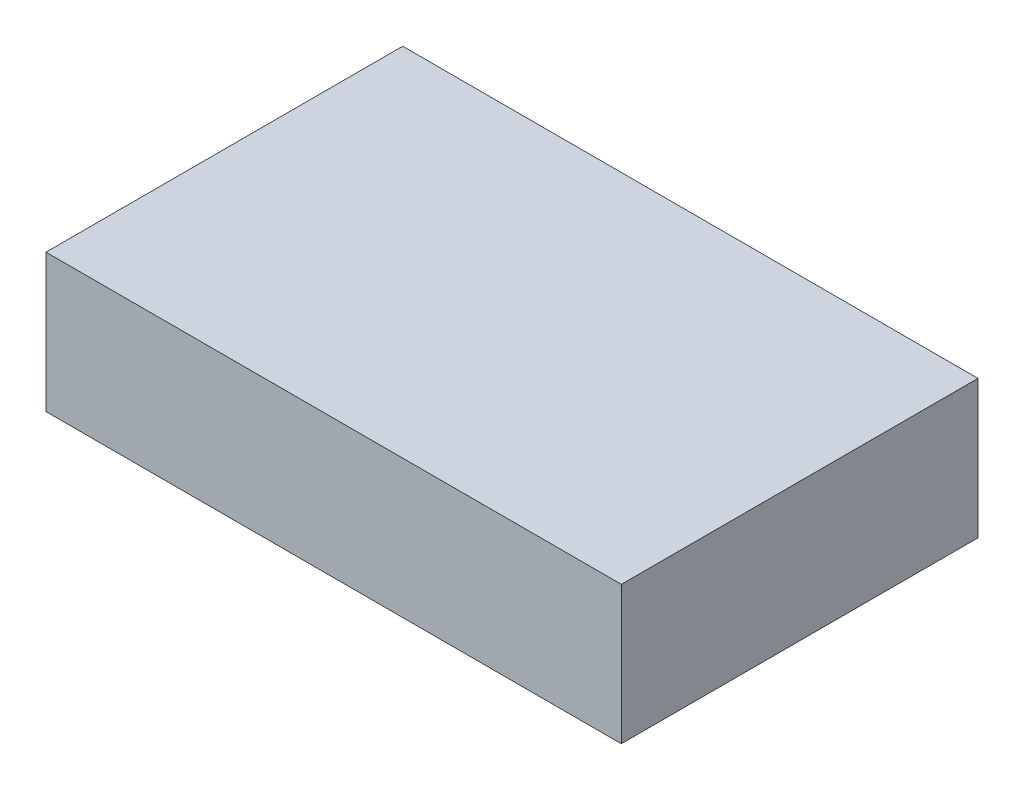
ISO-10303-21;
HEADER;
FILE_DESCRIPTION(('STEP AP214'),'2;1');
FILE_NAME('part.step','',(''),(''),'','','');
FILE_SCHEMA(('AUTOMOTIVE_DESIGN { 1 0 10303 214 1 1 1 1 }'));
ENDSEC;
DATA;
#1=APPLICATION_CONTEXT('core data for automotive mechanical design processes');
#2=APPLICATION_PROTOCOL_DEFINITION('international standard','automotive_design',2000,#1);
#3=PRODUCT_CONTEXT('',#1,'mechanical');
#4=PRODUCT('Part','Part','',(#3));
#5=PRODUCT_RELATED_PRODUCT_CATEGORY('part','',(#4));
#6=PRODUCT_DEFINITION_FORMATION('','',#4);
#7=PRODUCT_DEFINITION_CONTEXT('part definition',#1,'design');
#8=PRODUCT_DEFINITION('design','',#6,#7);
#9=PRODUCT_DEFINITION_SHAPE('','',#8);
#10=(LENGTH_UNIT() NAMED_UNIT(*) SI_UNIT(.MILLI.,.METRE.));
#11=(NAMED_UNIT(*) PLANE_ANGLE_UNIT() SI_UNIT($,.RADIAN.));
#12=(NAMED_UNIT(*) SI_UNIT($,.STERADIAN.) SOLID_ANGLE_UNIT());
#13=UNCERTAINTY_MEASURE_WITH_UNIT(LENGTH_MEASURE(1.E-05),#10,'distance_accuracy_value','');
#14=(GEOMETRIC_REPRESENTATION_CONTEXT(3) GLOBAL_UNCERTAINTY_ASSIGNED_CONTEXT((#13)) GLOBAL_UNIT_ASSIGNED_CONTEXT((#10,
#11,#12)) REPRESENTATION_CONTEXT('',''));
#15=CARTESIAN_POINT('',(0.,0.,0.));
#16=DIRECTION('',(0.,0.,1.));
#17=DIRECTION('',(1.,0.,0.));
#18=AXIS2_PLACEMENT_3D('',#15,#16,#17);
#19=CARTESIAN_POINT('',(79.375,38.1,49.2125));
#20=DIRECTION('',(-1.,0.,0.));
#21=DIRECTION('',(0.,0.,1.));
#22=AXIS2_PLACEMENT_3D('',#19,#20,#21);
#23=PLANE('',#22);
#24=DIRECTION('',(0.,0.,-1.));
#25=VECTOR('',#24,1.);
#26=CARTESIAN_POINT('',(79.375,0.,49.2125));
#27=LINE('',#26,#25);
#28=CARTESIAN_POINT('',(79.375,0.,49.2125));
#29=VERTEX_POINT('',#28);
#30=CARTESIAN_POINT('',(79.375,0.,-49.2125));
#31=VERTEX_POINT('',#30);
#32=EDGE_CURVE('E107',#29,#31,#27,.T.);
#33=ORIENTED_EDGE('',*,*,#32,.T.);
#34=DIRECTION('',(0.,-1.,0.));
#35=VECTOR('',#34,1.);
#36=CARTESIAN_POINT('',(79.375,38.1,-49.2125));
#37=LINE('',#36,#35);
#38=CARTESIAN_POINT('',(79.375,38.1,-49.2125));
#39=VERTEX_POINT('',#38);
#40=EDGE_CURVE('E11',#39,#31,#37,.T.);
#41=ORIENTED_EDGE('',*,*,#40,.F.);
#42=DIRECTION('',(0.,0.,-1.));
#43=VECTOR('',#42,1.);
#44=CARTESIAN_POINT('',(79.375,38.1,49.2125));
#45=LINE('',#44,#43);
#46=CARTESIAN_POINT('',(79.375,38.1,49.2125));
#47=VERTEX_POINT('',#46);
#48=EDGE_CURVE('E91',#47,#39,#45,.T.);
#49=ORIENTED_EDGE('',*,*,#48,.F.);
#50=DIRECTION('',(0.,-1.,0.));
#51=VECTOR('',#50,1.);
#52=CARTESIAN_POINT('',(79.375,38.1,49.2125));
#53=LINE('',#52,#51);
#54=EDGE_CURVE('E103',#47,#29,#53,.T.);
#55=ORIENTED_EDGE('',*,*,#54,.T.);
#56=EDGE_LOOP('',(#33,#41,#49,#55));
#57=FACE_BOUND('',#56,.T.);
#58=ADVANCED_FACE('F39',(#57),#23,.F.);
#59=CARTESIAN_POINT('',(-79.375,38.1,-49.2125));
#60=DIRECTION('',(0.,0.,1.));
#61=DIRECTION('',(1.,0.,0.));
#62=AXIS2_PLACEMENT_3D('',#59,#60,#61);
#63=PLANE('',#62);
#64=DIRECTION('',(-1.,0.,0.));
#65=VECTOR('',#64,1.);
#66=CARTESIAN_POINT('',(-79.375,0.,-49.2125));
#67=LINE('',#66,#65);
#68=CARTESIAN_POINT('',(-79.375,0.,-49.2125));
#69=VERTEX_POINT('',#68);
#70=EDGE_CURVE('E96',#31,#69,#67,.T.);
#71=ORIENTED_EDGE('',*,*,#70,.T.);
#72=DIRECTION('',(0.,-1.,0.));
#73=VECTOR('',#72,1.);
#74=CARTESIAN_POINT('',(-79.375,38.1,-49.2125));
#75=LINE('',#74,#73);
#76=CARTESIAN_POINT('',(-79.375,38.1,-49.2125));
#77=VERTEX_POINT('',#76);
#78=EDGE_CURVE('E48',#77,#69,#75,.T.);
#79=ORIENTED_EDGE('',*,*,#78,.F.);
#80=DIRECTION('',(-1.,0.,0.));
#81=VECTOR('',#80,1.);
#82=CARTESIAN_POINT('',(-79.375,38.1,-49.2125));
#83=LINE('',#82,#81);
#84=EDGE_CURVE('E86',#39,#77,#83,.T.);
#85=ORIENTED_EDGE('',*,*,#84,.F.);
#86=ORIENTED_EDGE('',*,*,#40,.T.);
#87=EDGE_LOOP('',(#71,#79,#85,#86));
#88=FACE_BOUND('',#87,.T.);
#89=ADVANCED_FACE('F95',(#88),#63,.F.);
#90=CARTESIAN_POINT('',(-79.375,38.1,49.2125));
#91=DIRECTION('',(1.,0.,0.));
#92=DIRECTION('',(0.,0.,-1.));
#93=AXIS2_PLACEMENT_3D('',#90,#91,#92);
#94=PLANE('',#93);
#95=DIRECTION('',(0.,0.,1.));
#96=VECTOR('',#95,1.);
#97=CARTESIAN_POINT('',(-79.375,0.,49.2125));
#98=LINE('',#97,#96);
#99=CARTESIAN_POINT('',(-79.375,0.,49.2125));
#100=VERTEX_POINT('',#99);
#101=EDGE_CURVE('E73',#69,#100,#98,.T.);
#102=ORIENTED_EDGE('',*,*,#101,.T.);
#103=DIRECTION('',(0.,-1.,0.));
#104=VECTOR('',#103,1.);
#105=CARTESIAN_POINT('',(-79.375,38.1,49.2125));
#106=LINE('',#105,#104);
#107=CARTESIAN_POINT('',(-79.375,38.1,49.2125));
#108=VERTEX_POINT('',#107);
#109=EDGE_CURVE('E98',#108,#100,#106,.T.);
#110=ORIENTED_EDGE('',*,*,#109,.F.);
#111=DIRECTION('',(0.,0.,1.));
#112=VECTOR('',#111,1.);
#113=CARTESIAN_POINT('',(-79.375,38.1,49.2125));
#114=LINE('',#113,#112);
#115=EDGE_CURVE('E89',#77,#108,#114,.T.);
#116=ORIENTED_EDGE('',*,*,#115,.F.);
#117=ORIENTED_EDGE('',*,*,#78,.T.);
#118=EDGE_LOOP('',(#102,#110,#116,#117));
#119=FACE_BOUND('',#118,.T.);
#120=ADVANCED_FACE('F99',(#119),#94,.F.);
#121=CARTESIAN_POINT('',(-79.375,38.1,49.2125));
#122=DIRECTION('',(0.,0.,-1.));
#123=DIRECTION('',(-1.,0.,0.));
#124=AXIS2_PLACEMENT_3D('',#121,#122,#123);
#125=PLANE('',#124);
#126=DIRECTION('',(1.,0.,0.));
#127=VECTOR('',#126,1.);
#128=CARTESIAN_POINT('',(-79.375,0.,49.2125));
#129=LINE('',#128,#127);
#130=EDGE_CURVE('E79',#100,#29,#129,.T.);
#131=ORIENTED_EDGE('',*,*,#130,.T.);
#132=ORIENTED_EDGE('',*,*,#54,.F.);
#133=DIRECTION('',(1.,0.,0.));
#134=VECTOR('',#133,1.);
#135=CARTESIAN_POINT('',(-79.375,38.1,49.2125));
#136=LINE('',#135,#134);
#137=EDGE_CURVE('E56',#108,#47,#136,.T.);
#138=ORIENTED_EDGE('',*,*,#137,.F.);
#139=ORIENTED_EDGE('',*,*,#109,.T.);
#140=EDGE_LOOP('',(#131,#132,#138,#139));
#141=FACE_BOUND('',#140,.T.);
#142=ADVANCED_FACE('F120',(#141),#125,.F.);
#143=CARTESIAN_POINT('',(0.,38.1,0.));
#144=DIRECTION('',(0.,-1.,0.));
#145=DIRECTION('',(0.,0.,-1.));
#146=AXIS2_PLACEMENT_3D('',#143,#144,#145);
#147=PLANE('',#146);
#148=ORIENTED_EDGE('',*,*,#48,.T.);
#149=ORIENTED_EDGE('',*,*,#84,.T.);
#150=ORIENTED_EDGE('',*,*,#115,.T.);
#151=ORIENTED_EDGE('',*,*,#137,.T.);
#152=EDGE_LOOP('',(#148,#149,#150,#151));
#153=FACE_BOUND('',#152,.T.);
#154=ADVANCED_FACE('F87',(#153),#147,.F.);
#155=CARTESIAN_POINT('',(0.,0.,0.));
#156=DIRECTION('',(0.,-1.,0.));
#157=DIRECTION('',(0.,0.,-1.));
#158=AXIS2_PLACEMENT_3D('',#155,#156,#157);
#159=PLANE('',#158);
#160=ORIENTED_EDGE('',*,*,#32,.F.);
#161=ORIENTED_EDGE('',*,*,#130,.F.);
#162=ORIENTED_EDGE('',*,*,#101,.F.);
#163=ORIENTED_EDGE('',*,*,#70,.F.);
#164=EDGE_LOOP('',(#160,#161,#162,#163));
#165=FACE_BOUND('',#164,.T.);
#166=ADVANCED_FACE('F123',(#165),#159,.T.);
#167=CLOSED_SHELL('',(#58,#89,#120,#142,#154,#166));
#168=MANIFOLD_SOLID_BREP('B2',#167);
#169=ADVANCED_BREP_SHAPE_REPRESENTATION('',(#18,#168),#14);
#170=SHAPE_DEFINITION_REPRESENTATION(#9,#169);
ENDSEC;
END-ISO-10303-21;
